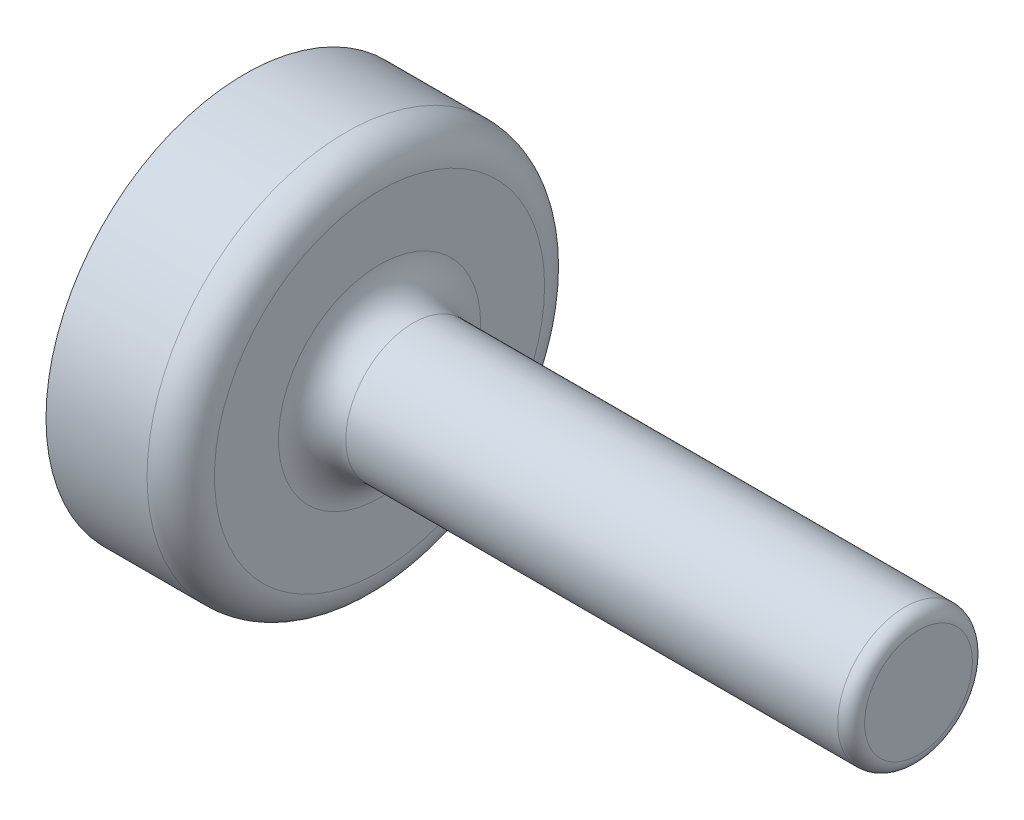
ISO-10303-21;
HEADER;
FILE_DESCRIPTION(('STEP AP214'),'2;1');
FILE_NAME('part.step','',(''),(''),'','','');
FILE_SCHEMA(('AUTOMOTIVE_DESIGN { 1 0 10303 214 1 1 1 1 }'));
ENDSEC;
DATA;
#1=APPLICATION_CONTEXT('core data for automotive mechanical design processes');
#2=APPLICATION_PROTOCOL_DEFINITION('international standard','automotive_design',2000,#1);
#3=PRODUCT_CONTEXT('',#1,'mechanical');
#4=PRODUCT('Part','Part','',(#3));
#5=PRODUCT_RELATED_PRODUCT_CATEGORY('part','',(#4));
#6=PRODUCT_DEFINITION_FORMATION('','',#4);
#7=PRODUCT_DEFINITION_CONTEXT('part definition',#1,'design');
#8=PRODUCT_DEFINITION('design','',#6,#7);
#9=PRODUCT_DEFINITION_SHAPE('','',#8);
#10=(LENGTH_UNIT() NAMED_UNIT(*) SI_UNIT(.MILLI.,.METRE.));
#11=(NAMED_UNIT(*) PLANE_ANGLE_UNIT() SI_UNIT($,.RADIAN.));
#12=(NAMED_UNIT(*) SI_UNIT($,.STERADIAN.) SOLID_ANGLE_UNIT());
#13=UNCERTAINTY_MEASURE_WITH_UNIT(LENGTH_MEASURE(1.E-05),#10,'distance_accuracy_value','');
#14=(GEOMETRIC_REPRESENTATION_CONTEXT(3) GLOBAL_UNCERTAINTY_ASSIGNED_CONTEXT((#13)) GLOBAL_UNIT_ASSIGNED_CONTEXT((#10,
#11,#12)) REPRESENTATION_CONTEXT('',''));
#15=CARTESIAN_POINT('',(0.,0.,0.));
#16=DIRECTION('',(0.,0.,1.));
#17=DIRECTION('',(1.,0.,0.));
#18=AXIS2_PLACEMENT_3D('',#15,#16,#17);
#19=CARTESIAN_POINT('',(-80.,0.,0.));
#20=DIRECTION('',(-1.,0.,0.));
#21=DIRECTION('',(0.,0.,1.));
#22=AXIS2_PLACEMENT_3D('',#19,#20,#21);
#23=CYLINDRICAL_SURFACE('',#22,29.5);
#24=CARTESIAN_POINT('',(-85.,0.,0.));
#25=DIRECTION('',(1.,0.,0.));
#26=DIRECTION('',(0.,0.,-1.));
#27=AXIS2_PLACEMENT_3D('',#24,#25,#26);
#28=CIRCLE('',#27,29.5);
#29=CARTESIAN_POINT('',(-85.,0.,-29.5));
#30=VERTEX_POINT('',#29);
#31=EDGE_CURVE('E51',#30,#30,#28,.F.);
#32=ORIENTED_EDGE('',*,*,#31,.T.);
#33=EDGE_LOOP('',(#32));
#34=FACE_BOUND('',#33,.T.);
#35=CARTESIAN_POINT('',(-100.,0.,0.));
#36=DIRECTION('',(1.,0.,0.));
#37=DIRECTION('',(0.,0.,-1.));
#38=AXIS2_PLACEMENT_3D('',#35,#36,#37);
#39=CIRCLE('',#38,29.5);
#40=CARTESIAN_POINT('',(-100.,0.,-29.5));
#41=VERTEX_POINT('',#40);
#42=EDGE_CURVE('E62',#41,#41,#39,.T.);
#43=ORIENTED_EDGE('',*,*,#42,.T.);
#44=EDGE_LOOP('',(#43));
#45=FACE_BOUND('',#44,.T.);
#46=ADVANCED_FACE('F36',(#34,#45),#23,.T.);
#47=CARTESIAN_POINT('',(-80.,0.,0.));
#48=DIRECTION('',(1.,0.,0.));
#49=DIRECTION('',(0.,0.,-1.));
#50=AXIS2_PLACEMENT_3D('',#47,#48,#49);
#51=PLANE('',#50);
#52=CARTESIAN_POINT('',(-80.,0.,0.));
#53=DIRECTION('',(1.,0.,0.));
#54=DIRECTION('',(0.,0.,-1.));
#55=AXIS2_PLACEMENT_3D('',#52,#53,#54);
#56=CIRCLE('',#55,24.5);
#57=CARTESIAN_POINT('',(-80.,0.,-24.5));
#58=VERTEX_POINT('',#57);
#59=EDGE_CURVE('E56',#58,#58,#56,.T.);
#60=ORIENTED_EDGE('',*,*,#59,.T.);
#61=EDGE_LOOP('',(#60));
#62=FACE_BOUND('',#61,.T.);
#63=CARTESIAN_POINT('',(-80.,0.,0.));
#64=DIRECTION('',(1.,0.,0.));
#65=DIRECTION('',(0.,0.,-1.));
#66=AXIS2_PLACEMENT_3D('',#63,#64,#65);
#67=CIRCLE('',#66,15.);
#68=CARTESIAN_POINT('',(-80.,0.,-15.));
#69=VERTEX_POINT('',#68);
#70=EDGE_CURVE('E59',#69,#69,#67,.F.);
#71=ORIENTED_EDGE('',*,*,#70,.T.);
#72=EDGE_LOOP('',(#71));
#73=FACE_BOUND('',#72,.T.);
#74=ADVANCED_FACE('F70',(#62,#73),#51,.T.);
#75=CARTESIAN_POINT('',(-100.,0.,0.));
#76=DIRECTION('',(1.,0.,0.));
#77=DIRECTION('',(0.,0.,-1.));
#78=AXIS2_PLACEMENT_3D('',#75,#76,#77);
#79=PLANE('',#78);
#80=ORIENTED_EDGE('',*,*,#42,.F.);
#81=EDGE_LOOP('',(#80));
#82=FACE_BOUND('',#81,.T.);
#83=ADVANCED_FACE('F67',(#82),#79,.F.);
#84=CARTESIAN_POINT('',(0.,0.,0.));
#85=DIRECTION('',(-1.,0.,0.));
#86=DIRECTION('',(0.,0.,1.));
#87=AXIS2_PLACEMENT_3D('',#84,#85,#86);
#88=CYLINDRICAL_SURFACE('',#87,10.);
#89=CARTESIAN_POINT('',(-2.,0.,0.));
#90=DIRECTION('',(1.,0.,0.));
#91=DIRECTION('',(0.,0.,-1.));
#92=AXIS2_PLACEMENT_3D('',#89,#90,#91);
#93=CIRCLE('',#92,10.);
#94=CARTESIAN_POINT('',(-2.,0.,-10.));
#95=VERTEX_POINT('',#94);
#96=EDGE_CURVE('E10',#95,#95,#93,.F.);
#97=ORIENTED_EDGE('',*,*,#96,.T.);
#98=EDGE_LOOP('',(#97));
#99=FACE_BOUND('',#98,.T.);
#100=CARTESIAN_POINT('',(-75.,0.,0.));
#101=DIRECTION('',(1.,0.,0.));
#102=DIRECTION('',(0.,0.,-1.));
#103=AXIS2_PLACEMENT_3D('',#100,#101,#102);
#104=CIRCLE('',#103,10.);
#105=CARTESIAN_POINT('',(-75.,0.,-10.));
#106=VERTEX_POINT('',#105);
#107=EDGE_CURVE('E47',#106,#106,#104,.T.);
#108=ORIENTED_EDGE('',*,*,#107,.T.);
#109=EDGE_LOOP('',(#108));
#110=FACE_BOUND('',#109,.T.);
#111=ADVANCED_FACE('F69',(#99,#110),#88,.T.);
#112=CARTESIAN_POINT('',(0.,0.,0.));
#113=DIRECTION('',(1.,0.,0.));
#114=DIRECTION('',(0.,0.,-1.));
#115=AXIS2_PLACEMENT_3D('',#112,#113,#114);
#116=PLANE('',#115);
#117=CARTESIAN_POINT('',(0.,0.,0.));
#118=DIRECTION('',(1.,0.,0.));
#119=DIRECTION('',(0.,0.,-1.));
#120=AXIS2_PLACEMENT_3D('',#117,#118,#119);
#121=CIRCLE('',#120,8.);
#122=CARTESIAN_POINT('',(0.,0.,-8.));
#123=VERTEX_POINT('',#122);
#124=EDGE_CURVE('E43',#123,#123,#121,.T.);
#125=ORIENTED_EDGE('',*,*,#124,.T.);
#126=EDGE_LOOP('',(#125));
#127=FACE_BOUND('',#126,.T.);
#128=ADVANCED_FACE('F75',(#127),#116,.T.);
#129=CARTESIAN_POINT('',(-85.,0.,0.));
#130=DIRECTION('',(1.,0.,0.));
#131=DIRECTION('',(0.,0.,-1.));
#132=AXIS2_PLACEMENT_3D('',#129,#130,#131);
#133=TOROIDAL_SURFACE('',#132,24.5,5.);
#134=ORIENTED_EDGE('',*,*,#31,.F.);
#135=EDGE_LOOP('',(#134));
#136=FACE_BOUND('',#135,.T.);
#137=ORIENTED_EDGE('',*,*,#59,.F.);
#138=EDGE_LOOP('',(#137));
#139=FACE_BOUND('',#138,.T.);
#140=ADVANCED_FACE('F87',(#136,#139),#133,.T.);
#141=CARTESIAN_POINT('',(-75.,0.,0.));
#142=DIRECTION('',(1.,0.,0.));
#143=DIRECTION('',(0.,0.,-1.));
#144=AXIS2_PLACEMENT_3D('',#141,#142,#143);
#145=TOROIDAL_SURFACE('',#144,15.,5.);
#146=ORIENTED_EDGE('',*,*,#70,.F.);
#147=EDGE_LOOP('',(#146));
#148=FACE_BOUND('',#147,.T.);
#149=ORIENTED_EDGE('',*,*,#107,.F.);
#150=EDGE_LOOP('',(#149));
#151=FACE_BOUND('',#150,.T.);
#152=ADVANCED_FACE('F88',(#148,#151),#145,.F.);
#153=CARTESIAN_POINT('',(-2.,0.,0.));
#154=DIRECTION('',(1.,0.,0.));
#155=DIRECTION('',(0.,0.,-1.));
#156=AXIS2_PLACEMENT_3D('',#153,#154,#155);
#157=TOROIDAL_SURFACE('',#156,8.,2.);
#158=ORIENTED_EDGE('',*,*,#96,.F.);
#159=EDGE_LOOP('',(#158));
#160=FACE_BOUND('',#159,.T.);
#161=ORIENTED_EDGE('',*,*,#124,.F.);
#162=EDGE_LOOP('',(#161));
#163=FACE_BOUND('',#162,.T.);
#164=ADVANCED_FACE('F38',(#160,#163),#157,.T.);
#165=CLOSED_SHELL('',(#46,#74,#83,#111,#128,#140,#152,#164));
#166=MANIFOLD_SOLID_BREP('B2',#165);
#167=ADVANCED_BREP_SHAPE_REPRESENTATION('',(#18,#166),#14);
#168=SHAPE_DEFINITION_REPRESENTATION(#9,#167);
ENDSEC;
END-ISO-10303-21;
